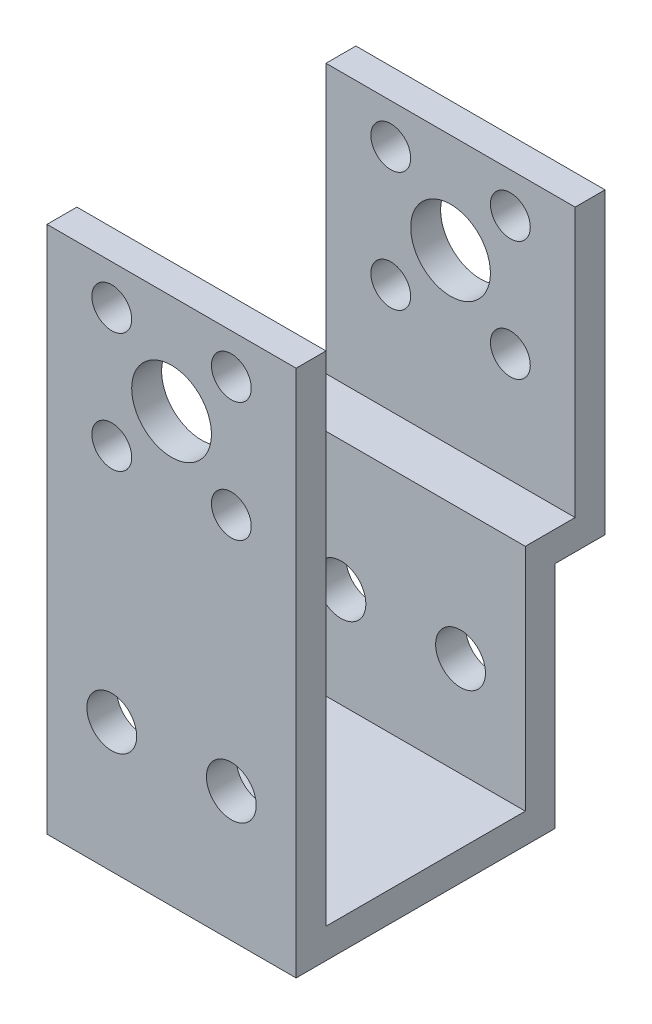
ISO-10303-21;
HEADER;
FILE_DESCRIPTION(('STEP AP214'),'2;1');
FILE_NAME('part.step','',(''),(''),'','','');
FILE_SCHEMA(('AUTOMOTIVE_DESIGN { 1 0 10303 214 1 1 1 1 }'));
ENDSEC;
DATA;
#1=APPLICATION_CONTEXT('core data for automotive mechanical design processes');
#2=APPLICATION_PROTOCOL_DEFINITION('international standard','automotive_design',2000,#1);
#3=PRODUCT_CONTEXT('',#1,'mechanical');
#4=PRODUCT('Part','Part','',(#3));
#5=PRODUCT_RELATED_PRODUCT_CATEGORY('part','',(#4));
#6=PRODUCT_DEFINITION_FORMATION('','',#4);
#7=PRODUCT_DEFINITION_CONTEXT('part definition',#1,'design');
#8=PRODUCT_DEFINITION('design','',#6,#7);
#9=PRODUCT_DEFINITION_SHAPE('','',#8);
#10=(LENGTH_UNIT() NAMED_UNIT(*) SI_UNIT(.MILLI.,.METRE.));
#11=(NAMED_UNIT(*) PLANE_ANGLE_UNIT() SI_UNIT($,.RADIAN.));
#12=(NAMED_UNIT(*) SI_UNIT($,.STERADIAN.) SOLID_ANGLE_UNIT());
#13=UNCERTAINTY_MEASURE_WITH_UNIT(LENGTH_MEASURE(1.E-05),#10,'distance_accuracy_value','');
#14=(GEOMETRIC_REPRESENTATION_CONTEXT(3) GLOBAL_UNCERTAINTY_ASSIGNED_CONTEXT((#13)) GLOBAL_UNIT_ASSIGNED_CONTEXT((#10,
#11,#12)) REPRESENTATION_CONTEXT('',''));
#15=CARTESIAN_POINT('',(0.,0.,0.));
#16=DIRECTION('',(0.,0.,1.));
#17=DIRECTION('',(1.,0.,0.));
#18=AXIS2_PLACEMENT_3D('',#15,#16,#17);
#19=CARTESIAN_POINT('',(0.,0.,3.));
#20=DIRECTION('',(1.,0.,0.));
#21=DIRECTION('',(0.,1.,0.));
#22=AXIS2_PLACEMENT_3D('',#19,#20,#21);
#23=PLANE('',#22);
#24=DIRECTION('',(0.,-1.,0.));
#25=VECTOR('',#24,1.);
#26=CARTESIAN_POINT('',(0.,0.,0.));
#27=LINE('',#26,#25);
#28=CARTESIAN_POINT('',(0.,50.,0.));
#29=VERTEX_POINT('',#28);
#30=CARTESIAN_POINT('',(0.,0.,0.));
#31=VERTEX_POINT('',#30);
#32=EDGE_CURVE('E80',#29,#31,#27,.T.);
#33=ORIENTED_EDGE('',*,*,#32,.T.);
#34=DIRECTION('',(0.,0.,-1.));
#35=VECTOR('',#34,1.);
#36=CARTESIAN_POINT('',(0.,0.,3.));
#37=LINE('',#36,#35);
#38=CARTESIAN_POINT('',(0.,0.,-20.));
#39=VERTEX_POINT('',#38);
#40=EDGE_CURVE('E146',#31,#39,#37,.T.);
#41=ORIENTED_EDGE('',*,*,#40,.T.);
#42=DIRECTION('',(0.,1.,0.));
#43=VECTOR('',#42,1.);
#44=CARTESIAN_POINT('',(0.,0.,-20.));
#45=LINE('',#44,#43);
#46=CARTESIAN_POINT('',(0.,23.0181330710231,-20.));
#47=VERTEX_POINT('',#46);
#48=EDGE_CURVE('E143',#39,#47,#45,.T.);
#49=ORIENTED_EDGE('',*,*,#48,.T.);
#50=DIRECTION('',(0.,0.,-1.));
#51=VECTOR('',#50,1.);
#52=CARTESIAN_POINT('',(0.,23.0181330710231,-20.));
#53=LINE('',#52,#51);
#54=CARTESIAN_POINT('',(0.,23.0181330710231,-25.));
#55=VERTEX_POINT('',#54);
#56=EDGE_CURVE('E140',#47,#55,#53,.T.);
#57=ORIENTED_EDGE('',*,*,#56,.T.);
#58=DIRECTION('',(0.,1.,0.));
#59=VECTOR('',#58,1.);
#60=CARTESIAN_POINT('',(0.,23.0181330710231,-25.));
#61=LINE('',#60,#59);
#62=CARTESIAN_POINT('',(0.,50.,-25.));
#63=VERTEX_POINT('',#62);
#64=EDGE_CURVE('E137',#55,#63,#61,.T.);
#65=ORIENTED_EDGE('',*,*,#64,.T.);
#66=DIRECTION('',(0.,0.,-1.));
#67=VECTOR('',#66,1.);
#68=CARTESIAN_POINT('',(0.,50.,-28.));
#69=LINE('',#68,#67);
#70=CARTESIAN_POINT('',(0.,50.,-28.));
#71=VERTEX_POINT('',#70);
#72=EDGE_CURVE('E134',#63,#71,#69,.T.);
#73=ORIENTED_EDGE('',*,*,#72,.T.);
#74=DIRECTION('',(0.,-1.,0.));
#75=VECTOR('',#74,1.);
#76=CARTESIAN_POINT('',(0.,20.0181330710231,-28.));
#77=LINE('',#76,#75);
#78=CARTESIAN_POINT('',(0.,20.0181330710231,-28.));
#79=VERTEX_POINT('',#78);
#80=EDGE_CURVE('E131',#71,#79,#77,.T.);
#81=ORIENTED_EDGE('',*,*,#80,.T.);
#82=DIRECTION('',(0.,0.,1.));
#83=VECTOR('',#82,1.);
#84=CARTESIAN_POINT('',(0.,20.0181330710231,-23.));
#85=LINE('',#84,#83);
#86=CARTESIAN_POINT('',(0.,20.0181330710231,-23.));
#87=VERTEX_POINT('',#86);
#88=EDGE_CURVE('E128',#79,#87,#85,.T.);
#89=ORIENTED_EDGE('',*,*,#88,.T.);
#90=DIRECTION('',(0.,-1.,0.));
#91=VECTOR('',#90,1.);
#92=CARTESIAN_POINT('',(0.,-3.,-23.));
#93=LINE('',#92,#91);
#94=CARTESIAN_POINT('',(0.,-3.,-23.));
#95=VERTEX_POINT('',#94);
#96=EDGE_CURVE('E125',#87,#95,#93,.T.);
#97=ORIENTED_EDGE('',*,*,#96,.T.);
#98=DIRECTION('',(0.,0.,1.));
#99=VECTOR('',#98,1.);
#100=CARTESIAN_POINT('',(0.,-3.,3.));
#101=LINE('',#100,#99);
#102=CARTESIAN_POINT('',(0.,-3.,3.));
#103=VERTEX_POINT('',#102);
#104=EDGE_CURVE('E122',#95,#103,#101,.T.);
#105=ORIENTED_EDGE('',*,*,#104,.T.);
#106=DIRECTION('',(0.,-1.,0.));
#107=VECTOR('',#106,1.);
#108=CARTESIAN_POINT('',(0.,0.,3.));
#109=LINE('',#108,#107);
#110=CARTESIAN_POINT('',(0.,50.,3.));
#111=VERTEX_POINT('',#110);
#112=EDGE_CURVE('E75',#111,#103,#109,.T.);
#113=ORIENTED_EDGE('',*,*,#112,.F.);
#114=DIRECTION('',(0.,0.,-1.));
#115=VECTOR('',#114,1.);
#116=CARTESIAN_POINT('',(0.,50.,3.));
#117=LINE('',#116,#115);
#118=EDGE_CURVE('E43',#111,#29,#117,.T.);
#119=ORIENTED_EDGE('',*,*,#118,.T.);
#120=EDGE_LOOP('',(#33,#41,#49,#57,#65,#73,#81,#89,#97,#105,#113,#119));
#121=FACE_BOUND('',#120,.T.);
#122=ADVANCED_FACE('F35',(#121),#23,.F.);
#123=CARTESIAN_POINT('',(25.,0.,3.));
#124=DIRECTION('',(-1.,0.,0.));
#125=DIRECTION('',(0.,-1.,0.));
#126=AXIS2_PLACEMENT_3D('',#123,#124,#125);
#127=PLANE('',#126);
#128=DIRECTION('',(0.,1.,0.));
#129=VECTOR('',#128,1.);
#130=CARTESIAN_POINT('',(25.,0.,0.));
#131=LINE('',#130,#129);
#132=CARTESIAN_POINT('',(25.,0.,0.));
#133=VERTEX_POINT('',#132);
#134=CARTESIAN_POINT('',(25.,50.,0.));
#135=VERTEX_POINT('',#134);
#136=EDGE_CURVE('E65',#133,#135,#131,.T.);
#137=ORIENTED_EDGE('',*,*,#136,.T.);
#138=DIRECTION('',(0.,0.,-1.));
#139=VECTOR('',#138,1.);
#140=CARTESIAN_POINT('',(25.,50.,3.));
#141=LINE('',#140,#139);
#142=CARTESIAN_POINT('',(25.,50.,3.));
#143=VERTEX_POINT('',#142);
#144=EDGE_CURVE('E11',#143,#135,#141,.T.);
#145=ORIENTED_EDGE('',*,*,#144,.F.);
#146=DIRECTION('',(0.,1.,0.));
#147=VECTOR('',#146,1.);
#148=CARTESIAN_POINT('',(25.,0.,3.));
#149=LINE('',#148,#147);
#150=CARTESIAN_POINT('',(25.,-3.,3.));
#151=VERTEX_POINT('',#150);
#152=EDGE_CURVE('E95',#151,#143,#149,.T.);
#153=ORIENTED_EDGE('',*,*,#152,.F.);
#154=DIRECTION('',(0.,0.,1.));
#155=VECTOR('',#154,1.);
#156=CARTESIAN_POINT('',(25.,-3.,3.));
#157=LINE('',#156,#155);
#158=CARTESIAN_POINT('',(25.,-3.,-23.));
#159=VERTEX_POINT('',#158);
#160=EDGE_CURVE('E102',#159,#151,#157,.T.);
#161=ORIENTED_EDGE('',*,*,#160,.F.);
#162=DIRECTION('',(0.,-1.,0.));
#163=VECTOR('',#162,1.);
#164=CARTESIAN_POINT('',(25.,-3.,-23.));
#165=LINE('',#164,#163);
#166=CARTESIAN_POINT('',(25.,20.0181330710231,-23.));
#167=VERTEX_POINT('',#166);
#168=EDGE_CURVE('E151',#167,#159,#165,.T.);
#169=ORIENTED_EDGE('',*,*,#168,.F.);
#170=DIRECTION('',(0.,0.,1.));
#171=VECTOR('',#170,1.);
#172=CARTESIAN_POINT('',(25.,20.0181330710231,-23.));
#173=LINE('',#172,#171);
#174=CARTESIAN_POINT('',(25.,20.0181330710231,-28.));
#175=VERTEX_POINT('',#174);
#176=EDGE_CURVE('E154',#175,#167,#173,.T.);
#177=ORIENTED_EDGE('',*,*,#176,.F.);
#178=DIRECTION('',(0.,-1.,0.));
#179=VECTOR('',#178,1.);
#180=CARTESIAN_POINT('',(25.,20.0181330710231,-28.));
#181=LINE('',#180,#179);
#182=CARTESIAN_POINT('',(25.,50.,-28.));
#183=VERTEX_POINT('',#182);
#184=EDGE_CURVE('E157',#183,#175,#181,.T.);
#185=ORIENTED_EDGE('',*,*,#184,.F.);
#186=DIRECTION('',(0.,0.,-1.));
#187=VECTOR('',#186,1.);
#188=CARTESIAN_POINT('',(25.,50.,-28.));
#189=LINE('',#188,#187);
#190=CARTESIAN_POINT('',(25.,50.,-25.));
#191=VERTEX_POINT('',#190);
#192=EDGE_CURVE('E160',#191,#183,#189,.T.);
#193=ORIENTED_EDGE('',*,*,#192,.F.);
#194=DIRECTION('',(0.,1.,0.));
#195=VECTOR('',#194,1.);
#196=CARTESIAN_POINT('',(25.,23.0181330710231,-25.));
#197=LINE('',#196,#195);
#198=CARTESIAN_POINT('',(25.,23.0181330710231,-25.));
#199=VERTEX_POINT('',#198);
#200=EDGE_CURVE('E163',#199,#191,#197,.T.);
#201=ORIENTED_EDGE('',*,*,#200,.F.);
#202=DIRECTION('',(0.,0.,-1.));
#203=VECTOR('',#202,1.);
#204=CARTESIAN_POINT('',(25.,23.0181330710231,-20.));
#205=LINE('',#204,#203);
#206=CARTESIAN_POINT('',(25.,23.0181330710231,-20.));
#207=VERTEX_POINT('',#206);
#208=EDGE_CURVE('E166',#207,#199,#205,.T.);
#209=ORIENTED_EDGE('',*,*,#208,.F.);
#210=DIRECTION('',(0.,1.,0.));
#211=VECTOR('',#210,1.);
#212=CARTESIAN_POINT('',(25.,0.,-20.));
#213=LINE('',#212,#211);
#214=CARTESIAN_POINT('',(25.,0.,-20.));
#215=VERTEX_POINT('',#214);
#216=EDGE_CURVE('E169',#215,#207,#213,.T.);
#217=ORIENTED_EDGE('',*,*,#216,.F.);
#218=DIRECTION('',(0.,0.,-1.));
#219=VECTOR('',#218,1.);
#220=CARTESIAN_POINT('',(25.,0.,3.));
#221=LINE('',#220,#219);
#222=EDGE_CURVE('E124',#133,#215,#221,.T.);
#223=ORIENTED_EDGE('',*,*,#222,.F.);
#224=EDGE_LOOP('',(#137,#145,#153,#161,#169,#177,#185,#193,#201,#209,#217,#223));
#225=FACE_BOUND('',#224,.T.);
#226=ADVANCED_FACE('F341',(#225),#127,.F.);
#227=CARTESIAN_POINT('',(0.,50.,3.));
#228=DIRECTION('',(0.,-1.,0.));
#229=DIRECTION('',(1.,0.,0.));
#230=AXIS2_PLACEMENT_3D('',#227,#228,#229);
#231=PLANE('',#230);
#232=DIRECTION('',(-1.,0.,0.));
#233=VECTOR('',#232,1.);
#234=CARTESIAN_POINT('',(0.,50.,0.));
#235=LINE('',#234,#233);
#236=EDGE_CURVE('E69',#135,#29,#235,.T.);
#237=ORIENTED_EDGE('',*,*,#236,.T.);
#238=ORIENTED_EDGE('',*,*,#118,.F.);
#239=DIRECTION('',(-1.,0.,0.));
#240=VECTOR('',#239,1.);
#241=CARTESIAN_POINT('',(0.,50.,3.));
#242=LINE('',#241,#240);
#243=EDGE_CURVE('E51',#143,#111,#242,.T.);
#244=ORIENTED_EDGE('',*,*,#243,.F.);
#245=ORIENTED_EDGE('',*,*,#144,.T.);
#246=EDGE_LOOP('',(#237,#238,#244,#245));
#247=FACE_BOUND('',#246,.T.);
#248=ADVANCED_FACE('F71',(#247),#231,.F.);
#249=CARTESIAN_POINT('',(0.,0.,3.));
#250=DIRECTION('',(0.,0.,-1.));
#251=DIRECTION('',(-1.,0.,0.));
#252=AXIS2_PLACEMENT_3D('',#249,#250,#251);
#253=PLANE('',#252);
#254=CARTESIAN_POINT('',(18.5,34.,3.));
#255=DIRECTION('',(0.,0.,-1.));
#256=DIRECTION('',(-1.,0.,0.));
#257=AXIS2_PLACEMENT_3D('',#254,#255,#256);
#258=CIRCLE('',#257,2.);
#259=CARTESIAN_POINT('',(16.5,34.,3.));
#260=VERTEX_POINT('',#259);
#261=EDGE_CURVE('E199',#260,#260,#258,.F.);
#262=ORIENTED_EDGE('',*,*,#261,.F.);
#263=EDGE_LOOP('',(#262));
#264=FACE_BOUND('',#263,.T.);
#265=CARTESIAN_POINT('',(18.5,46.,3.));
#266=DIRECTION('',(0.,0.,-1.));
#267=DIRECTION('',(-1.,0.,0.));
#268=AXIS2_PLACEMENT_3D('',#265,#266,#267);
#269=CIRCLE('',#268,2.);
#270=CARTESIAN_POINT('',(16.5,46.,3.));
#271=VERTEX_POINT('',#270);
#272=EDGE_CURVE('E211',#271,#271,#269,.F.);
#273=ORIENTED_EDGE('',*,*,#272,.F.);
#274=EDGE_LOOP('',(#273));
#275=FACE_BOUND('',#274,.T.);
#276=CARTESIAN_POINT('',(18.5,10.,3.));
#277=DIRECTION('',(0.,0.,-1.));
#278=DIRECTION('',(-1.,0.,0.));
#279=AXIS2_PLACEMENT_3D('',#276,#277,#278);
#280=CIRCLE('',#279,2.5);
#281=CARTESIAN_POINT('',(16.,10.,3.));
#282=VERTEX_POINT('',#281);
#283=EDGE_CURVE('E179',#282,#282,#280,.F.);
#284=ORIENTED_EDGE('',*,*,#283,.F.);
#285=EDGE_LOOP('',(#284));
#286=FACE_BOUND('',#285,.T.);
#287=CARTESIAN_POINT('',(6.50000000000001,10.,3.));
#288=DIRECTION('',(0.,0.,-1.));
#289=DIRECTION('',(-1.,0.,0.));
#290=AXIS2_PLACEMENT_3D('',#287,#288,#289);
#291=CIRCLE('',#290,2.5);
#292=CARTESIAN_POINT('',(4.00000000000001,10.,3.));
#293=VERTEX_POINT('',#292);
#294=EDGE_CURVE('E187',#293,#293,#291,.F.);
#295=ORIENTED_EDGE('',*,*,#294,.F.);
#296=EDGE_LOOP('',(#295));
#297=FACE_BOUND('',#296,.T.);
#298=CARTESIAN_POINT('',(6.5,34.,3.));
#299=DIRECTION('',(0.,0.,-1.));
#300=DIRECTION('',(-1.,0.,0.));
#301=AXIS2_PLACEMENT_3D('',#298,#299,#300);
#302=CIRCLE('',#301,2.00000000000001);
#303=CARTESIAN_POINT('',(4.5,34.,3.));
#304=VERTEX_POINT('',#303);
#305=EDGE_CURVE('E247',#304,#304,#302,.F.);
#306=ORIENTED_EDGE('',*,*,#305,.F.);
#307=EDGE_LOOP('',(#306));
#308=FACE_BOUND('',#307,.T.);
#309=CARTESIAN_POINT('',(12.5,40.,3.));
#310=DIRECTION('',(0.,0.,-1.));
#311=DIRECTION('',(-1.,0.,0.));
#312=AXIS2_PLACEMENT_3D('',#309,#310,#311);
#313=CIRCLE('',#312,3.99999999999999);
#314=CARTESIAN_POINT('',(8.50000000000001,40.,3.));
#315=VERTEX_POINT('',#314);
#316=EDGE_CURVE('E223',#315,#315,#313,.F.);
#317=ORIENTED_EDGE('',*,*,#316,.F.);
#318=EDGE_LOOP('',(#317));
#319=FACE_BOUND('',#318,.T.);
#320=CARTESIAN_POINT('',(6.5,46.,3.));
#321=DIRECTION('',(0.,0.,-1.));
#322=DIRECTION('',(-1.,0.,0.));
#323=AXIS2_PLACEMENT_3D('',#320,#321,#322);
#324=CIRCLE('',#323,2.00000000000001);
#325=CARTESIAN_POINT('',(4.5,46.,3.));
#326=VERTEX_POINT('',#325);
#327=EDGE_CURVE('E235',#326,#326,#324,.F.);
#328=ORIENTED_EDGE('',*,*,#327,.F.);
#329=EDGE_LOOP('',(#328));
#330=FACE_BOUND('',#329,.T.);
#331=ORIENTED_EDGE('',*,*,#112,.T.);
#332=DIRECTION('',(-1.,0.,0.));
#333=VECTOR('',#332,1.);
#334=CARTESIAN_POINT('',(25.,-3.,3.));
#335=LINE('',#334,#333);
#336=EDGE_CURVE('E86',#151,#103,#335,.T.);
#337=ORIENTED_EDGE('',*,*,#336,.F.);
#338=ORIENTED_EDGE('',*,*,#152,.T.);
#339=ORIENTED_EDGE('',*,*,#243,.T.);
#340=EDGE_LOOP('',(#331,#337,#338,#339));
#341=FACE_BOUND('',#340,.T.);
#342=ADVANCED_FACE('F264',(#264,#275,#286,#297,#308,#319,#330,#341),#253,.F.);
#343=CARTESIAN_POINT('',(0.,0.,0.));
#344=DIRECTION('',(0.,0.,-1.));
#345=DIRECTION('',(-1.,0.,0.));
#346=AXIS2_PLACEMENT_3D('',#343,#344,#345);
#347=PLANE('',#346);
#348=CARTESIAN_POINT('',(18.5,34.,0.));
#349=DIRECTION('',(0.,0.,-1.));
#350=DIRECTION('',(-1.,0.,0.));
#351=AXIS2_PLACEMENT_3D('',#348,#349,#350);
#352=CIRCLE('',#351,2.);
#353=CARTESIAN_POINT('',(16.5,34.,0.));
#354=VERTEX_POINT('',#353);
#355=EDGE_CURVE('E207',#354,#354,#352,.T.);
#356=ORIENTED_EDGE('',*,*,#355,.F.);
#357=EDGE_LOOP('',(#356));
#358=FACE_BOUND('',#357,.T.);
#359=CARTESIAN_POINT('',(18.5,46.,0.));
#360=DIRECTION('',(0.,0.,-1.));
#361=DIRECTION('',(1.,0.,0.));
#362=AXIS2_PLACEMENT_3D('',#359,#360,#361);
#363=CIRCLE('',#362,2.);
#364=CARTESIAN_POINT('',(20.5,46.,0.));
#365=VERTEX_POINT('',#364);
#366=EDGE_CURVE('E219',#365,#365,#363,.T.);
#367=ORIENTED_EDGE('',*,*,#366,.F.);
#368=EDGE_LOOP('',(#367));
#369=FACE_BOUND('',#368,.T.);
#370=CARTESIAN_POINT('',(18.5,10.,0.));
#371=DIRECTION('',(0.,0.,-1.));
#372=DIRECTION('',(-1.,0.,0.));
#373=AXIS2_PLACEMENT_3D('',#370,#371,#372);
#374=CIRCLE('',#373,2.5);
#375=CARTESIAN_POINT('',(16.,10.,0.));
#376=VERTEX_POINT('',#375);
#377=EDGE_CURVE('E183',#376,#376,#374,.T.);
#378=ORIENTED_EDGE('',*,*,#377,.F.);
#379=EDGE_LOOP('',(#378));
#380=FACE_BOUND('',#379,.T.);
#381=CARTESIAN_POINT('',(6.50000000000001,10.,0.));
#382=DIRECTION('',(0.,0.,-1.));
#383=DIRECTION('',(1.,0.,0.));
#384=AXIS2_PLACEMENT_3D('',#381,#382,#383);
#385=CIRCLE('',#384,2.5);
#386=CARTESIAN_POINT('',(9.00000000000001,10.,0.));
#387=VERTEX_POINT('',#386);
#388=EDGE_CURVE('E195',#387,#387,#385,.T.);
#389=ORIENTED_EDGE('',*,*,#388,.F.);
#390=EDGE_LOOP('',(#389));
#391=FACE_BOUND('',#390,.T.);
#392=CARTESIAN_POINT('',(6.5,34.,0.));
#393=DIRECTION('',(0.,0.,-1.));
#394=DIRECTION('',(1.,0.,0.));
#395=AXIS2_PLACEMENT_3D('',#392,#393,#394);
#396=CIRCLE('',#395,2.00000000000001);
#397=CARTESIAN_POINT('',(8.50000000000001,34.,0.));
#398=VERTEX_POINT('',#397);
#399=EDGE_CURVE('E254',#398,#398,#396,.T.);
#400=ORIENTED_EDGE('',*,*,#399,.F.);
#401=EDGE_LOOP('',(#400));
#402=FACE_BOUND('',#401,.T.);
#403=CARTESIAN_POINT('',(12.5,40.,0.));
#404=DIRECTION('',(0.,0.,-1.));
#405=DIRECTION('',(-1.,0.,0.));
#406=AXIS2_PLACEMENT_3D('',#403,#404,#405);
#407=CIRCLE('',#406,3.99999999999999);
#408=CARTESIAN_POINT('',(8.50000000000001,40.,0.));
#409=VERTEX_POINT('',#408);
#410=EDGE_CURVE('E231',#409,#409,#407,.T.);
#411=ORIENTED_EDGE('',*,*,#410,.F.);
#412=EDGE_LOOP('',(#411));
#413=FACE_BOUND('',#412,.T.);
#414=CARTESIAN_POINT('',(6.5,46.,0.));
#415=DIRECTION('',(0.,0.,-1.));
#416=DIRECTION('',(-1.,0.,0.));
#417=AXIS2_PLACEMENT_3D('',#414,#415,#416);
#418=CIRCLE('',#417,2.00000000000001);
#419=CARTESIAN_POINT('',(4.5,46.,0.));
#420=VERTEX_POINT('',#419);
#421=EDGE_CURVE('E243',#420,#420,#418,.T.);
#422=ORIENTED_EDGE('',*,*,#421,.F.);
#423=EDGE_LOOP('',(#422));
#424=FACE_BOUND('',#423,.T.);
#425=ORIENTED_EDGE('',*,*,#32,.F.);
#426=ORIENTED_EDGE('',*,*,#236,.F.);
#427=ORIENTED_EDGE('',*,*,#136,.F.);
#428=DIRECTION('',(1.,0.,0.));
#429=VECTOR('',#428,1.);
#430=CARTESIAN_POINT('',(0.,0.,0.));
#431=LINE('',#430,#429);
#432=EDGE_CURVE('E85',#31,#133,#431,.T.);
#433=ORIENTED_EDGE('',*,*,#432,.F.);
#434=EDGE_LOOP('',(#425,#426,#427,#433));
#435=FACE_BOUND('',#434,.T.);
#436=ADVANCED_FACE('F83',(#358,#369,#380,#391,#402,#413,#424,#435),#347,.T.);
#437=CARTESIAN_POINT('',(25.,-3.,3.));
#438=DIRECTION('',(0.,-1.,0.));
#439=DIRECTION('',(0.,0.,-1.));
#440=AXIS2_PLACEMENT_3D('',#437,#438,#439);
#441=PLANE('',#440);
#442=ORIENTED_EDGE('',*,*,#104,.F.);
#443=DIRECTION('',(-1.,0.,0.));
#444=VECTOR('',#443,1.);
#445=CARTESIAN_POINT('',(25.,-3.,-23.));
#446=LINE('',#445,#444);
#447=EDGE_CURVE('E90',#159,#95,#446,.T.);
#448=ORIENTED_EDGE('',*,*,#447,.F.);
#449=ORIENTED_EDGE('',*,*,#160,.T.);
#450=ORIENTED_EDGE('',*,*,#336,.T.);
#451=EDGE_LOOP('',(#442,#448,#449,#450));
#452=FACE_BOUND('',#451,.T.);
#453=ADVANCED_FACE('F263',(#452),#441,.T.);
#454=CARTESIAN_POINT('',(25.,-3.,-23.));
#455=DIRECTION('',(0.,0.,-1.));
#456=DIRECTION('',(-1.,0.,0.));
#457=AXIS2_PLACEMENT_3D('',#454,#455,#456);
#458=PLANE('',#457);
#459=CARTESIAN_POINT('',(6.50000000000001,10.,-23.));
#460=DIRECTION('',(0.,0.,-1.));
#461=DIRECTION('',(-1.,0.,0.));
#462=AXIS2_PLACEMENT_3D('',#459,#460,#461);
#463=CIRCLE('',#462,2.5);
#464=CARTESIAN_POINT('',(4.00000000000001,10.,-23.));
#465=VERTEX_POINT('',#464);
#466=EDGE_CURVE('E180',#465,#465,#463,.T.);
#467=ORIENTED_EDGE('',*,*,#466,.F.);
#468=EDGE_LOOP('',(#467));
#469=FACE_BOUND('',#468,.T.);
#470=CARTESIAN_POINT('',(18.5,10.,-23.));
#471=DIRECTION('',(0.,0.,-1.));
#472=DIRECTION('',(-1.,0.,0.));
#473=AXIS2_PLACEMENT_3D('',#470,#471,#472);
#474=CIRCLE('',#473,2.5);
#475=CARTESIAN_POINT('',(16.,10.,-23.));
#476=VERTEX_POINT('',#475);
#477=EDGE_CURVE('E148',#476,#476,#474,.T.);
#478=ORIENTED_EDGE('',*,*,#477,.F.);
#479=EDGE_LOOP('',(#478));
#480=FACE_BOUND('',#479,.T.);
#481=ORIENTED_EDGE('',*,*,#96,.F.);
#482=DIRECTION('',(-1.,0.,0.));
#483=VECTOR('',#482,1.);
#484=CARTESIAN_POINT('',(25.,20.0181330710231,-23.));
#485=LINE('',#484,#483);
#486=EDGE_CURVE('E117',#167,#87,#485,.T.);
#487=ORIENTED_EDGE('',*,*,#486,.F.);
#488=ORIENTED_EDGE('',*,*,#168,.T.);
#489=ORIENTED_EDGE('',*,*,#447,.T.);
#490=EDGE_LOOP('',(#481,#487,#488,#489));
#491=FACE_BOUND('',#490,.T.);
#492=ADVANCED_FACE('F298',(#469,#480,#491),#458,.T.);
#493=CARTESIAN_POINT('',(25.,20.0181330710231,-23.));
#494=DIRECTION('',(0.,-1.,0.));
#495=DIRECTION('',(0.,0.,-1.));
#496=AXIS2_PLACEMENT_3D('',#493,#494,#495);
#497=PLANE('',#496);
#498=ORIENTED_EDGE('',*,*,#88,.F.);
#499=DIRECTION('',(-1.,0.,0.));
#500=VECTOR('',#499,1.);
#501=CARTESIAN_POINT('',(25.,20.0181330710231,-28.));
#502=LINE('',#501,#500);
#503=EDGE_CURVE('E114',#175,#79,#502,.T.);
#504=ORIENTED_EDGE('',*,*,#503,.F.);
#505=ORIENTED_EDGE('',*,*,#176,.T.);
#506=ORIENTED_EDGE('',*,*,#486,.T.);
#507=EDGE_LOOP('',(#498,#504,#505,#506));
#508=FACE_BOUND('',#507,.T.);
#509=ADVANCED_FACE('F401',(#508),#497,.T.);
#510=CARTESIAN_POINT('',(25.,20.0181330710231,-28.));
#511=DIRECTION('',(0.,0.,-1.));
#512=DIRECTION('',(-1.,0.,0.));
#513=AXIS2_PLACEMENT_3D('',#510,#511,#512);
#514=PLANE('',#513);
#515=CARTESIAN_POINT('',(18.5,46.,-28.));
#516=DIRECTION('',(0.,0.,-1.));
#517=DIRECTION('',(-1.,0.,0.));
#518=AXIS2_PLACEMENT_3D('',#515,#516,#517);
#519=CIRCLE('',#518,2.);
#520=CARTESIAN_POINT('',(16.5,46.,-28.));
#521=VERTEX_POINT('',#520);
#522=EDGE_CURVE('E204',#521,#521,#519,.T.);
#523=ORIENTED_EDGE('',*,*,#522,.F.);
#524=EDGE_LOOP('',(#523));
#525=FACE_BOUND('',#524,.T.);
#526=CARTESIAN_POINT('',(12.5,40.,-28.));
#527=DIRECTION('',(0.,0.,-1.));
#528=DIRECTION('',(-1.,0.,0.));
#529=AXIS2_PLACEMENT_3D('',#526,#527,#528);
#530=CIRCLE('',#529,3.99999999999999);
#531=CARTESIAN_POINT('',(8.50000000000001,40.,-28.));
#532=VERTEX_POINT('',#531);
#533=EDGE_CURVE('E216',#532,#532,#530,.T.);
#534=ORIENTED_EDGE('',*,*,#533,.F.);
#535=EDGE_LOOP('',(#534));
#536=FACE_BOUND('',#535,.T.);
#537=CARTESIAN_POINT('',(18.5,34.,-28.));
#538=DIRECTION('',(0.,0.,-1.));
#539=DIRECTION('',(-1.,0.,0.));
#540=AXIS2_PLACEMENT_3D('',#537,#538,#539);
#541=CIRCLE('',#540,2.);
#542=CARTESIAN_POINT('',(16.5,34.,-28.));
#543=VERTEX_POINT('',#542);
#544=EDGE_CURVE('E192',#543,#543,#541,.T.);
#545=ORIENTED_EDGE('',*,*,#544,.F.);
#546=EDGE_LOOP('',(#545));
#547=FACE_BOUND('',#546,.T.);
#548=CARTESIAN_POINT('',(6.5,46.,-28.));
#549=DIRECTION('',(0.,0.,-1.));
#550=DIRECTION('',(-1.,0.,0.));
#551=AXIS2_PLACEMENT_3D('',#548,#549,#550);
#552=CIRCLE('',#551,2.00000000000001);
#553=CARTESIAN_POINT('',(4.5,46.,-28.));
#554=VERTEX_POINT('',#553);
#555=EDGE_CURVE('E228',#554,#554,#552,.T.);
#556=ORIENTED_EDGE('',*,*,#555,.F.);
#557=EDGE_LOOP('',(#556));
#558=FACE_BOUND('',#557,.T.);
#559=CARTESIAN_POINT('',(6.5,34.,-28.));
#560=DIRECTION('',(0.,0.,-1.));
#561=DIRECTION('',(-1.,0.,0.));
#562=AXIS2_PLACEMENT_3D('',#559,#560,#561);
#563=CIRCLE('',#562,2.00000000000001);
#564=CARTESIAN_POINT('',(4.5,34.,-28.));
#565=VERTEX_POINT('',#564);
#566=EDGE_CURVE('E240',#565,#565,#563,.T.);
#567=ORIENTED_EDGE('',*,*,#566,.F.);
#568=EDGE_LOOP('',(#567));
#569=FACE_BOUND('',#568,.T.);
#570=ORIENTED_EDGE('',*,*,#80,.F.);
#571=DIRECTION('',(-1.,0.,0.));
#572=VECTOR('',#571,1.);
#573=CARTESIAN_POINT('',(25.,50.,-28.));
#574=LINE('',#573,#572);
#575=EDGE_CURVE('E111',#183,#71,#574,.T.);
#576=ORIENTED_EDGE('',*,*,#575,.F.);
#577=ORIENTED_EDGE('',*,*,#184,.T.);
#578=ORIENTED_EDGE('',*,*,#503,.T.);
#579=EDGE_LOOP('',(#570,#576,#577,#578));
#580=FACE_BOUND('',#579,.T.);
#581=ADVANCED_FACE('F330',(#525,#536,#547,#558,#569,#580),#514,.T.);
#582=CARTESIAN_POINT('',(25.,50.,-28.));
#583=DIRECTION('',(0.,1.,0.));
#584=DIRECTION('',(-1.,0.,0.));
#585=AXIS2_PLACEMENT_3D('',#582,#583,#584);
#586=PLANE('',#585);
#587=ORIENTED_EDGE('',*,*,#72,.F.);
#588=DIRECTION('',(-1.,0.,0.));
#589=VECTOR('',#588,1.);
#590=CARTESIAN_POINT('',(25.,50.,-25.));
#591=LINE('',#590,#589);
#592=EDGE_CURVE('E108',#191,#63,#591,.T.);
#593=ORIENTED_EDGE('',*,*,#592,.F.);
#594=ORIENTED_EDGE('',*,*,#192,.T.);
#595=ORIENTED_EDGE('',*,*,#575,.T.);
#596=EDGE_LOOP('',(#587,#593,#594,#595));
#597=FACE_BOUND('',#596,.T.);
#598=ADVANCED_FACE('F324',(#597),#586,.T.);
#599=CARTESIAN_POINT('',(25.,23.0181330710231,-25.));
#600=DIRECTION('',(0.,0.,1.));
#601=DIRECTION('',(1.,0.,0.));
#602=AXIS2_PLACEMENT_3D('',#599,#600,#601);
#603=PLANE('',#602);
#604=CARTESIAN_POINT('',(18.5,46.,-25.));
#605=DIRECTION('',(0.,0.,1.));
#606=DIRECTION('',(1.,0.,0.));
#607=AXIS2_PLACEMENT_3D('',#604,#605,#606);
#608=CIRCLE('',#607,2.);
#609=CARTESIAN_POINT('',(20.5,46.,-25.));
#610=VERTEX_POINT('',#609);
#611=EDGE_CURVE('E208',#610,#610,#608,.T.);
#612=ORIENTED_EDGE('',*,*,#611,.F.);
#613=EDGE_LOOP('',(#612));
#614=FACE_BOUND('',#613,.T.);
#615=CARTESIAN_POINT('',(12.5,40.,-25.));
#616=DIRECTION('',(0.,0.,1.));
#617=DIRECTION('',(1.,0.,0.));
#618=AXIS2_PLACEMENT_3D('',#615,#616,#617);
#619=CIRCLE('',#618,3.99999999999999);
#620=CARTESIAN_POINT('',(16.5,40.,-25.));
#621=VERTEX_POINT('',#620);
#622=EDGE_CURVE('E220',#621,#621,#619,.T.);
#623=ORIENTED_EDGE('',*,*,#622,.F.);
#624=EDGE_LOOP('',(#623));
#625=FACE_BOUND('',#624,.T.);
#626=CARTESIAN_POINT('',(18.5,34.,-25.));
#627=DIRECTION('',(0.,0.,1.));
#628=DIRECTION('',(1.,0.,0.));
#629=AXIS2_PLACEMENT_3D('',#626,#627,#628);
#630=CIRCLE('',#629,2.);
#631=CARTESIAN_POINT('',(20.5,34.,-25.));
#632=VERTEX_POINT('',#631);
#633=EDGE_CURVE('E196',#632,#632,#630,.T.);
#634=ORIENTED_EDGE('',*,*,#633,.F.);
#635=EDGE_LOOP('',(#634));
#636=FACE_BOUND('',#635,.T.);
#637=CARTESIAN_POINT('',(6.5,46.,-25.));
#638=DIRECTION('',(0.,0.,1.));
#639=DIRECTION('',(1.,0.,0.));
#640=AXIS2_PLACEMENT_3D('',#637,#638,#639);
#641=CIRCLE('',#640,2.00000000000001);
#642=CARTESIAN_POINT('',(8.50000000000001,46.,-25.));
#643=VERTEX_POINT('',#642);
#644=EDGE_CURVE('E232',#643,#643,#641,.T.);
#645=ORIENTED_EDGE('',*,*,#644,.F.);
#646=EDGE_LOOP('',(#645));
#647=FACE_BOUND('',#646,.T.);
#648=CARTESIAN_POINT('',(6.5,34.,-25.));
#649=DIRECTION('',(0.,0.,1.));
#650=DIRECTION('',(1.,0.,0.));
#651=AXIS2_PLACEMENT_3D('',#648,#649,#650);
#652=CIRCLE('',#651,2.00000000000001);
#653=CARTESIAN_POINT('',(8.50000000000001,34.,-25.));
#654=VERTEX_POINT('',#653);
#655=EDGE_CURVE('E244',#654,#654,#652,.T.);
#656=ORIENTED_EDGE('',*,*,#655,.F.);
#657=EDGE_LOOP('',(#656));
#658=FACE_BOUND('',#657,.T.);
#659=ORIENTED_EDGE('',*,*,#64,.F.);
#660=DIRECTION('',(-1.,0.,0.));
#661=VECTOR('',#660,1.);
#662=CARTESIAN_POINT('',(25.,23.0181330710231,-25.));
#663=LINE('',#662,#661);
#664=EDGE_CURVE('E105',#199,#55,#663,.T.);
#665=ORIENTED_EDGE('',*,*,#664,.F.);
#666=ORIENTED_EDGE('',*,*,#200,.T.);
#667=ORIENTED_EDGE('',*,*,#592,.T.);
#668=EDGE_LOOP('',(#659,#665,#666,#667));
#669=FACE_BOUND('',#668,.T.);
#670=ADVANCED_FACE('F336',(#614,#625,#636,#647,#658,#669),#603,.T.);
#671=CARTESIAN_POINT('',(25.,23.0181330710231,-20.));
#672=DIRECTION('',(0.,1.,0.));
#673=DIRECTION('',(-1.,0.,0.));
#674=AXIS2_PLACEMENT_3D('',#671,#672,#673);
#675=PLANE('',#674);
#676=ORIENTED_EDGE('',*,*,#56,.F.);
#677=DIRECTION('',(-1.,0.,0.));
#678=VECTOR('',#677,1.);
#679=CARTESIAN_POINT('',(25.,23.0181330710231,-20.));
#680=LINE('',#679,#678);
#681=EDGE_CURVE('E101',#207,#47,#680,.T.);
#682=ORIENTED_EDGE('',*,*,#681,.F.);
#683=ORIENTED_EDGE('',*,*,#208,.T.);
#684=ORIENTED_EDGE('',*,*,#664,.T.);
#685=EDGE_LOOP('',(#676,#682,#683,#684));
#686=FACE_BOUND('',#685,.T.);
#687=ADVANCED_FACE('F360',(#686),#675,.T.);
#688=CARTESIAN_POINT('',(25.,0.,-20.));
#689=DIRECTION('',(0.,0.,1.));
#690=DIRECTION('',(1.,0.,0.));
#691=AXIS2_PLACEMENT_3D('',#688,#689,#690);
#692=PLANE('',#691);
#693=CARTESIAN_POINT('',(6.50000000000001,10.,-20.));
#694=DIRECTION('',(0.,0.,1.));
#695=DIRECTION('',(1.,0.,0.));
#696=AXIS2_PLACEMENT_3D('',#693,#694,#695);
#697=CIRCLE('',#696,2.5);
#698=CARTESIAN_POINT('',(9.00000000000001,10.,-20.));
#699=VERTEX_POINT('',#698);
#700=EDGE_CURVE('E184',#699,#699,#697,.T.);
#701=ORIENTED_EDGE('',*,*,#700,.F.);
#702=EDGE_LOOP('',(#701));
#703=FACE_BOUND('',#702,.T.);
#704=CARTESIAN_POINT('',(18.5,10.,-20.));
#705=DIRECTION('',(0.,0.,1.));
#706=DIRECTION('',(1.,0.,0.));
#707=AXIS2_PLACEMENT_3D('',#704,#705,#706);
#708=CIRCLE('',#707,2.5);
#709=CARTESIAN_POINT('',(21.,10.,-20.));
#710=VERTEX_POINT('',#709);
#711=EDGE_CURVE('E176',#710,#710,#708,.T.);
#712=ORIENTED_EDGE('',*,*,#711,.F.);
#713=EDGE_LOOP('',(#712));
#714=FACE_BOUND('',#713,.T.);
#715=ORIENTED_EDGE('',*,*,#48,.F.);
#716=DIRECTION('',(-1.,0.,0.));
#717=VECTOR('',#716,1.);
#718=CARTESIAN_POINT('',(25.,0.,-20.));
#719=LINE('',#718,#717);
#720=EDGE_CURVE('E98',#215,#39,#719,.T.);
#721=ORIENTED_EDGE('',*,*,#720,.F.);
#722=ORIENTED_EDGE('',*,*,#216,.T.);
#723=ORIENTED_EDGE('',*,*,#681,.T.);
#724=EDGE_LOOP('',(#715,#721,#722,#723));
#725=FACE_BOUND('',#724,.T.);
#726=ADVANCED_FACE('F358',(#703,#714,#725),#692,.T.);
#727=CARTESIAN_POINT('',(25.,0.,3.));
#728=DIRECTION('',(0.,1.,0.));
#729=DIRECTION('',(0.,0.,1.));
#730=AXIS2_PLACEMENT_3D('',#727,#728,#729);
#731=PLANE('',#730);
#732=ORIENTED_EDGE('',*,*,#40,.F.);
#733=ORIENTED_EDGE('',*,*,#432,.T.);
#734=ORIENTED_EDGE('',*,*,#222,.T.);
#735=ORIENTED_EDGE('',*,*,#720,.T.);
#736=EDGE_LOOP('',(#732,#733,#734,#735));
#737=FACE_BOUND('',#736,.T.);
#738=ADVANCED_FACE('F354',(#737),#731,.T.);
#739=CARTESIAN_POINT('',(18.5,10.,-28.001));
#740=DIRECTION('',(0.,0.,1.));
#741=DIRECTION('',(1.,0.,0.));
#742=AXIS2_PLACEMENT_3D('',#739,#740,#741);
#743=CYLINDRICAL_SURFACE('',#742,2.5);
#744=ORIENTED_EDGE('',*,*,#477,.T.);
#745=EDGE_LOOP('',(#744));
#746=FACE_BOUND('',#745,.T.);
#747=ORIENTED_EDGE('',*,*,#711,.T.);
#748=EDGE_LOOP('',(#747));
#749=FACE_BOUND('',#748,.T.);
#750=ADVANCED_FACE('F381',(#746,#749),#743,.F.);
#751=CARTESIAN_POINT('',(6.50000000000001,10.,-28.001));
#752=DIRECTION('',(0.,0.,1.));
#753=DIRECTION('',(1.,0.,0.));
#754=AXIS2_PLACEMENT_3D('',#751,#752,#753);
#755=CYLINDRICAL_SURFACE('',#754,2.5);
#756=ORIENTED_EDGE('',*,*,#466,.T.);
#757=EDGE_LOOP('',(#756));
#758=FACE_BOUND('',#757,.T.);
#759=ORIENTED_EDGE('',*,*,#700,.T.);
#760=EDGE_LOOP('',(#759));
#761=FACE_BOUND('',#760,.T.);
#762=ADVANCED_FACE('F385',(#758,#761),#755,.F.);
#763=CARTESIAN_POINT('',(6.5,34.,-28.001));
#764=DIRECTION('',(0.,0.,1.));
#765=DIRECTION('',(1.,0.,0.));
#766=AXIS2_PLACEMENT_3D('',#763,#764,#765);
#767=CYLINDRICAL_SURFACE('',#766,2.00000000000001);
#768=ORIENTED_EDGE('',*,*,#566,.T.);
#769=EDGE_LOOP('',(#768));
#770=FACE_BOUND('',#769,.T.);
#771=ORIENTED_EDGE('',*,*,#655,.T.);
#772=EDGE_LOOP('',(#771));
#773=FACE_BOUND('',#772,.T.);
#774=ADVANCED_FACE('F391',(#770,#773),#767,.F.);
#775=CARTESIAN_POINT('',(6.5,46.,-28.001));
#776=DIRECTION('',(0.,0.,1.));
#777=DIRECTION('',(1.,0.,0.));
#778=AXIS2_PLACEMENT_3D('',#775,#776,#777);
#779=CYLINDRICAL_SURFACE('',#778,2.00000000000001);
#780=ORIENTED_EDGE('',*,*,#555,.T.);
#781=EDGE_LOOP('',(#780));
#782=FACE_BOUND('',#781,.T.);
#783=ORIENTED_EDGE('',*,*,#644,.T.);
#784=EDGE_LOOP('',(#783));
#785=FACE_BOUND('',#784,.T.);
#786=ADVANCED_FACE('F448',(#782,#785),#779,.F.);
#787=CARTESIAN_POINT('',(18.5,34.,-28.001));
#788=DIRECTION('',(0.,0.,1.));
#789=DIRECTION('',(1.,0.,0.));
#790=AXIS2_PLACEMENT_3D('',#787,#788,#789);
#791=CYLINDRICAL_SURFACE('',#790,2.);
#792=ORIENTED_EDGE('',*,*,#544,.T.);
#793=EDGE_LOOP('',(#792));
#794=FACE_BOUND('',#793,.T.);
#795=ORIENTED_EDGE('',*,*,#633,.T.);
#796=EDGE_LOOP('',(#795));
#797=FACE_BOUND('',#796,.T.);
#798=ADVANCED_FACE('F458',(#794,#797),#791,.F.);
#799=CARTESIAN_POINT('',(12.5,40.,-28.001));
#800=DIRECTION('',(0.,0.,1.));
#801=DIRECTION('',(1.,0.,0.));
#802=AXIS2_PLACEMENT_3D('',#799,#800,#801);
#803=CYLINDRICAL_SURFACE('',#802,3.99999999999999);
#804=ORIENTED_EDGE('',*,*,#533,.T.);
#805=EDGE_LOOP('',(#804));
#806=FACE_BOUND('',#805,.T.);
#807=ORIENTED_EDGE('',*,*,#622,.T.);
#808=EDGE_LOOP('',(#807));
#809=FACE_BOUND('',#808,.T.);
#810=ADVANCED_FACE('F468',(#806,#809),#803,.F.);
#811=CARTESIAN_POINT('',(18.5,46.,-28.001));
#812=DIRECTION('',(0.,0.,1.));
#813=DIRECTION('',(1.,0.,0.));
#814=AXIS2_PLACEMENT_3D('',#811,#812,#813);
#815=CYLINDRICAL_SURFACE('',#814,2.);
#816=ORIENTED_EDGE('',*,*,#522,.T.);
#817=EDGE_LOOP('',(#816));
#818=FACE_BOUND('',#817,.T.);
#819=ORIENTED_EDGE('',*,*,#611,.T.);
#820=EDGE_LOOP('',(#819));
#821=FACE_BOUND('',#820,.T.);
#822=ADVANCED_FACE('F275',(#818,#821),#815,.F.);
#823=CARTESIAN_POINT('',(6.5,46.,3.001));
#824=DIRECTION('',(0.,0.,-1.));
#825=DIRECTION('',(-1.,0.,0.));
#826=AXIS2_PLACEMENT_3D('',#823,#824,#825);
#827=CYLINDRICAL_SURFACE('',#826,2.00000000000001);
#828=ORIENTED_EDGE('',*,*,#421,.T.);
#829=EDGE_LOOP('',(#828));
#830=FACE_BOUND('',#829,.T.);
#831=ORIENTED_EDGE('',*,*,#327,.T.);
#832=EDGE_LOOP('',(#831));
#833=FACE_BOUND('',#832,.T.);
#834=ADVANCED_FACE('F271',(#830,#833),#827,.F.);
#835=CARTESIAN_POINT('',(12.5,40.,3.001));
#836=DIRECTION('',(0.,0.,-1.));
#837=DIRECTION('',(-1.,0.,0.));
#838=AXIS2_PLACEMENT_3D('',#835,#836,#837);
#839=CYLINDRICAL_SURFACE('',#838,3.99999999999999);
#840=ORIENTED_EDGE('',*,*,#410,.T.);
#841=EDGE_LOOP('',(#840));
#842=FACE_BOUND('',#841,.T.);
#843=ORIENTED_EDGE('',*,*,#316,.T.);
#844=EDGE_LOOP('',(#843));
#845=FACE_BOUND('',#844,.T.);
#846=ADVANCED_FACE('F274',(#842,#845),#839,.F.);
#847=CARTESIAN_POINT('',(6.5,34.,3.001));
#848=DIRECTION('',(0.,0.,-1.));
#849=DIRECTION('',(-1.,0.,0.));
#850=AXIS2_PLACEMENT_3D('',#847,#848,#849);
#851=CYLINDRICAL_SURFACE('',#850,2.00000000000001);
#852=ORIENTED_EDGE('',*,*,#399,.T.);
#853=EDGE_LOOP('',(#852));
#854=FACE_BOUND('',#853,.T.);
#855=ORIENTED_EDGE('',*,*,#305,.T.);
#856=EDGE_LOOP('',(#855));
#857=FACE_BOUND('',#856,.T.);
#858=ADVANCED_FACE('F258',(#854,#857),#851,.F.);
#859=CARTESIAN_POINT('',(6.50000000000001,10.,3.001));
#860=DIRECTION('',(0.,0.,-1.));
#861=DIRECTION('',(-1.,0.,0.));
#862=AXIS2_PLACEMENT_3D('',#859,#860,#861);
#863=CYLINDRICAL_SURFACE('',#862,2.5);
#864=ORIENTED_EDGE('',*,*,#388,.T.);
#865=EDGE_LOOP('',(#864));
#866=FACE_BOUND('',#865,.T.);
#867=ORIENTED_EDGE('',*,*,#294,.T.);
#868=EDGE_LOOP('',(#867));
#869=FACE_BOUND('',#868,.T.);
#870=ADVANCED_FACE('F511',(#866,#869),#863,.F.);
#871=CARTESIAN_POINT('',(18.5,10.,3.001));
#872=DIRECTION('',(0.,0.,-1.));
#873=DIRECTION('',(-1.,0.,0.));
#874=AXIS2_PLACEMENT_3D('',#871,#872,#873);
#875=CYLINDRICAL_SURFACE('',#874,2.5);
#876=ORIENTED_EDGE('',*,*,#377,.T.);
#877=EDGE_LOOP('',(#876));
#878=FACE_BOUND('',#877,.T.);
#879=ORIENTED_EDGE('',*,*,#283,.T.);
#880=EDGE_LOOP('',(#879));
#881=FACE_BOUND('',#880,.T.);
#882=ADVANCED_FACE('F520',(#878,#881),#875,.F.);
#883=CARTESIAN_POINT('',(18.5,46.,3.001));
#884=DIRECTION('',(0.,0.,-1.));
#885=DIRECTION('',(-1.,0.,0.));
#886=AXIS2_PLACEMENT_3D('',#883,#884,#885);
#887=CYLINDRICAL_SURFACE('',#886,2.);
#888=ORIENTED_EDGE('',*,*,#366,.T.);
#889=EDGE_LOOP('',(#888));
#890=FACE_BOUND('',#889,.T.);
#891=ORIENTED_EDGE('',*,*,#272,.T.);
#892=EDGE_LOOP('',(#891));
#893=FACE_BOUND('',#892,.T.);
#894=ADVANCED_FACE('F530',(#890,#893),#887,.F.);
#895=CARTESIAN_POINT('',(18.5,34.,3.001));
#896=DIRECTION('',(0.,0.,-1.));
#897=DIRECTION('',(-1.,0.,0.));
#898=AXIS2_PLACEMENT_3D('',#895,#896,#897);
#899=CYLINDRICAL_SURFACE('',#898,2.);
#900=ORIENTED_EDGE('',*,*,#355,.T.);
#901=EDGE_LOOP('',(#900));
#902=FACE_BOUND('',#901,.T.);
#903=ORIENTED_EDGE('',*,*,#261,.T.);
#904=EDGE_LOOP('',(#903));
#905=FACE_BOUND('',#904,.T.);
#906=ADVANCED_FACE('F539',(#902,#905),#899,.F.);
#907=CLOSED_SHELL('',(#122,#226,#248,#342,#436,#453,#492,#509,#581,#598,#670,#687,#726,#738,
#750,#762,#774,#786,#798,#810,#822,#834,#846,#858,#870,#882,#894,#906));
#908=MANIFOLD_SOLID_BREP('B2',#907);
#909=ADVANCED_BREP_SHAPE_REPRESENTATION('',(#18,#908),#14);
#910=SHAPE_DEFINITION_REPRESENTATION(#9,#909);
ENDSEC;
END-ISO-10303-21;
